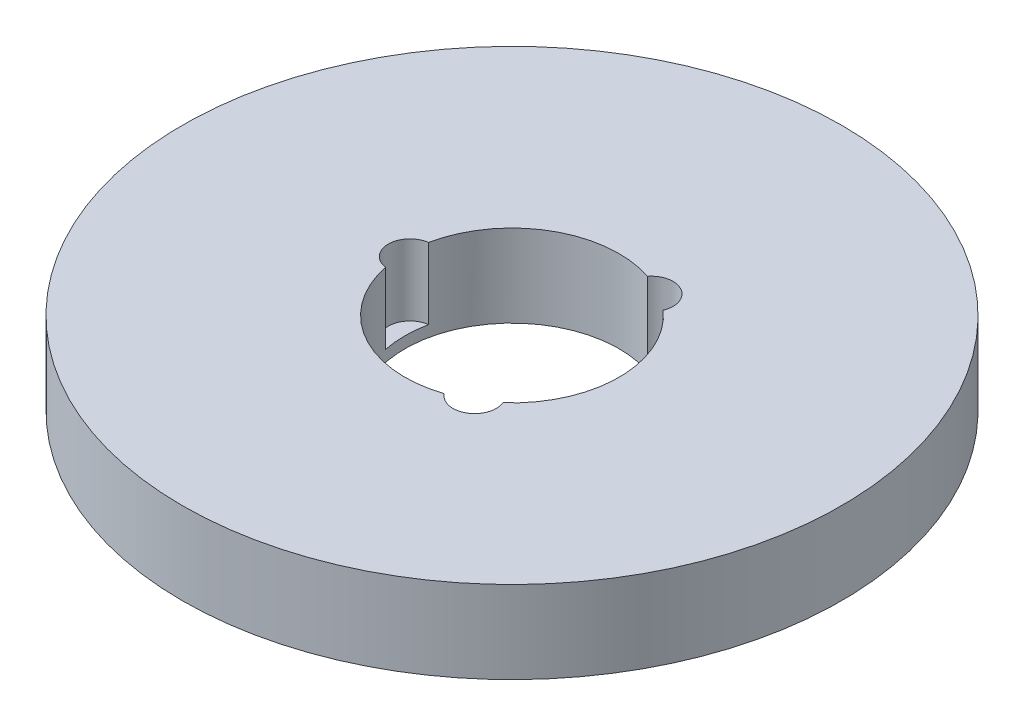
ISO-10303-21;
HEADER;
FILE_DESCRIPTION(('STEP AP214'),'2;1');
FILE_NAME('part.step','',(''),(''),'','','');
FILE_SCHEMA(('AUTOMOTIVE_DESIGN { 1 0 10303 214 1 1 1 1 }'));
ENDSEC;
DATA;
#1=APPLICATION_CONTEXT('core data for automotive mechanical design processes');
#2=APPLICATION_PROTOCOL_DEFINITION('international standard','automotive_design',2000,#1);
#3=PRODUCT_CONTEXT('',#1,'mechanical');
#4=PRODUCT('Part','Part','',(#3));
#5=PRODUCT_RELATED_PRODUCT_CATEGORY('part','',(#4));
#6=PRODUCT_DEFINITION_FORMATION('','',#4);
#7=PRODUCT_DEFINITION_CONTEXT('part definition',#1,'design');
#8=PRODUCT_DEFINITION('design','',#6,#7);
#9=PRODUCT_DEFINITION_SHAPE('','',#8);
#10=(LENGTH_UNIT() NAMED_UNIT(*) SI_UNIT(.MILLI.,.METRE.));
#11=(NAMED_UNIT(*) PLANE_ANGLE_UNIT() SI_UNIT($,.RADIAN.));
#12=(NAMED_UNIT(*) SI_UNIT($,.STERADIAN.) SOLID_ANGLE_UNIT());
#13=UNCERTAINTY_MEASURE_WITH_UNIT(LENGTH_MEASURE(1.E-05),#10,'distance_accuracy_value','');
#14=(GEOMETRIC_REPRESENTATION_CONTEXT(3) GLOBAL_UNCERTAINTY_ASSIGNED_CONTEXT((#13)) GLOBAL_UNIT_ASSIGNED_CONTEXT((#10,
#11,#12)) REPRESENTATION_CONTEXT('',''));
#15=CARTESIAN_POINT('',(0.,0.,0.));
#16=DIRECTION('',(0.,0.,1.));
#17=DIRECTION('',(1.,0.,0.));
#18=AXIS2_PLACEMENT_3D('',#15,#16,#17);
#19=CARTESIAN_POINT('',(0.,25.,0.));
#20=DIRECTION('',(0.,-1.,0.));
#21=DIRECTION('',(0.,0.,-1.));
#22=AXIS2_PLACEMENT_3D('',#19,#20,#21);
#23=CYLINDRICAL_SURFACE('',#22,100.);
#24=CARTESIAN_POINT('',(0.,25.,0.));
#25=DIRECTION('',(0.,1.,0.));
#26=DIRECTION('',(0.,0.,1.));
#27=AXIS2_PLACEMENT_3D('',#24,#25,#26);
#28=CIRCLE('',#27,100.);
#29=CARTESIAN_POINT('',(0.,25.,100.));
#30=VERTEX_POINT('',#29);
#31=EDGE_CURVE('E130',#30,#30,#28,.T.);
#32=ORIENTED_EDGE('',*,*,#31,.F.);
#33=EDGE_LOOP('',(#32));
#34=FACE_BOUND('',#33,.T.);
#35=CARTESIAN_POINT('',(0.,0.,0.));
#36=DIRECTION('',(0.,1.,0.));
#37=DIRECTION('',(0.,0.,1.));
#38=AXIS2_PLACEMENT_3D('',#35,#36,#37);
#39=CIRCLE('',#38,100.);
#40=CARTESIAN_POINT('',(0.,0.,100.));
#41=VERTEX_POINT('',#40);
#42=EDGE_CURVE('E117',#41,#41,#39,.T.);
#43=ORIENTED_EDGE('',*,*,#42,.T.);
#44=EDGE_LOOP('',(#43));
#45=FACE_BOUND('',#44,.T.);
#46=ADVANCED_FACE('F39',(#34,#45),#23,.T.);
#47=CARTESIAN_POINT('',(0.,25.,0.));
#48=DIRECTION('',(0.,1.,0.));
#49=DIRECTION('',(0.,0.,1.));
#50=AXIS2_PLACEMENT_3D('',#47,#48,#49);
#51=PLANE('',#50);
#52=CARTESIAN_POINT('',(15.4759458741744,25.,26.8051245492558));
#53=DIRECTION('',(0.,1.,0.));
#54=DIRECTION('',(0.866025403784436,0.,-0.500000000000004));
#55=AXIS2_PLACEMENT_3D('',#52,#53,#54);
#56=CIRCLE('',#55,6.58557208859873);
#57=CARTESIAN_POINT('',(10.2676622109279,25.,30.8354522055747));
#58=VERTEX_POINT('',#57);
#59=CARTESIAN_POINT('',(21.5704538417449,25.,24.3097824149282));
#60=VERTEX_POINT('',#59);
#61=EDGE_CURVE('E148',#58,#60,#56,.T.);
#62=ORIENTED_EDGE('',*,*,#61,.F.);
#63=CARTESIAN_POINT('',(0.,25.,0.));
#64=DIRECTION('',(0.,1.,0.));
#65=DIRECTION('',(0.,0.,1.));
#66=AXIS2_PLACEMENT_3D('',#63,#64,#65);
#67=CIRCLE('',#66,32.5);
#68=CARTESIAN_POINT('',(-31.8381160526725,25.,6.5256697906465));
#69=VERTEX_POINT('',#68);
#70=EDGE_CURVE('E113',#69,#58,#67,.T.);
#71=ORIENTED_EDGE('',*,*,#70,.F.);
#72=CARTESIAN_POINT('',(-30.9518917483486,25.,0.));
#73=DIRECTION('',(0.,1.,0.));
#74=DIRECTION('',(0.,0.,1.));
#75=AXIS2_PLACEMENT_3D('',#72,#73,#74);
#76=CIRCLE('',#75,6.58557208859873);
#77=CARTESIAN_POINT('',(-31.8381160526725,25.,-6.5256697906465));
#78=VERTEX_POINT('',#77);
#79=EDGE_CURVE('E125',#78,#69,#76,.T.);
#80=ORIENTED_EDGE('',*,*,#79,.F.);
#81=CARTESIAN_POINT('',(10.2676622109274,25.,-30.8354522055749));
#82=VERTEX_POINT('',#81);
#83=EDGE_CURVE('E107',#82,#78,#67,.T.);
#84=ORIENTED_EDGE('',*,*,#83,.F.);
#85=CARTESIAN_POINT('',(15.4759458741741,25.,-26.805124549256));
#86=DIRECTION('',(0.,1.,0.));
#87=DIRECTION('',(-0.866025403784443,0.,-0.499999999999992));
#88=AXIS2_PLACEMENT_3D('',#85,#86,#87);
#89=CIRCLE('',#88,6.58557208859873);
#90=CARTESIAN_POINT('',(21.5704538417446,25.,-24.3097824149285));
#91=VERTEX_POINT('',#90);
#92=EDGE_CURVE('E95',#91,#82,#89,.T.);
#93=ORIENTED_EDGE('',*,*,#92,.F.);
#94=EDGE_CURVE('E106',#60,#91,#67,.T.);
#95=ORIENTED_EDGE('',*,*,#94,.F.);
#96=EDGE_LOOP('',(#62,#71,#80,#84,#93,#95));
#97=FACE_BOUND('',#96,.T.);
#98=ORIENTED_EDGE('',*,*,#31,.T.);
#99=EDGE_LOOP('',(#98));
#100=FACE_BOUND('',#99,.T.);
#101=ADVANCED_FACE('F102',(#97,#100),#51,.T.);
#102=CARTESIAN_POINT('',(0.,0.,0.));
#103=DIRECTION('',(0.,1.,0.));
#104=DIRECTION('',(0.,0.,1.));
#105=AXIS2_PLACEMENT_3D('',#102,#103,#104);
#106=PLANE('',#105);
#107=CARTESIAN_POINT('',(0.,0.,0.));
#108=DIRECTION('',(0.,1.,0.));
#109=DIRECTION('',(0.,0.,1.));
#110=AXIS2_PLACEMENT_3D('',#107,#108,#109);
#111=CIRCLE('',#110,32.5);
#112=CARTESIAN_POINT('',(0.,0.,32.5));
#113=VERTEX_POINT('',#112);
#114=EDGE_CURVE('E118',#113,#113,#111,.T.);
#115=ORIENTED_EDGE('',*,*,#114,.T.);
#116=EDGE_LOOP('',(#115));
#117=FACE_BOUND('',#116,.T.);
#118=ORIENTED_EDGE('',*,*,#42,.F.);
#119=EDGE_LOOP('',(#118));
#120=FACE_BOUND('',#119,.T.);
#121=ADVANCED_FACE('F161',(#117,#120),#106,.F.);
#122=CARTESIAN_POINT('',(0.,25.,0.));
#123=DIRECTION('',(0.,-1.,0.));
#124=DIRECTION('',(0.,0.,-1.));
#125=AXIS2_PLACEMENT_3D('',#122,#123,#124);
#126=CYLINDRICAL_SURFACE('',#125,32.5);
#127=DIRECTION('',(0.,1.,0.));
#128=VECTOR('',#127,1.);
#129=CARTESIAN_POINT('',(10.2676622109279,14.2063744967564,30.8354522055747));
#130=LINE('',#129,#128);
#131=CARTESIAN_POINT('',(10.2676622109279,3.41274899351281,30.8354522055747));
#132=VERTEX_POINT('',#131);
#133=EDGE_CURVE('E11',#132,#58,#130,.T.);
#134=ORIENTED_EDGE('',*,*,#133,.F.);
#135=CARTESIAN_POINT('',(0.,3.41274899351281,0.));
#136=DIRECTION('',(0.,1.,0.));
#137=DIRECTION('',(0.,0.,1.));
#138=AXIS2_PLACEMENT_3D('',#135,#136,#137);
#139=CIRCLE('',#138,32.5);
#140=CARTESIAN_POINT('',(21.5704538417449,3.41274899351281,24.3097824149282));
#141=VERTEX_POINT('',#140);
#142=EDGE_CURVE('E100',#132,#141,#139,.T.);
#143=ORIENTED_EDGE('',*,*,#142,.T.);
#144=DIRECTION('',(0.,1.,0.));
#145=VECTOR('',#144,1.);
#146=CARTESIAN_POINT('',(21.5704538417449,14.2063744967564,24.3097824149282));
#147=LINE('',#146,#145);
#148=EDGE_CURVE('E46',#60,#141,#147,.F.);
#149=ORIENTED_EDGE('',*,*,#148,.F.);
#150=ORIENTED_EDGE('',*,*,#94,.T.);
#151=DIRECTION('',(0.,1.,0.));
#152=VECTOR('',#151,1.);
#153=CARTESIAN_POINT('',(21.5704538417446,14.2063744967564,-24.3097824149285));
#154=LINE('',#153,#152);
#155=CARTESIAN_POINT('',(21.5704538417446,3.41274899351281,-24.3097824149285));
#156=VERTEX_POINT('',#155);
#157=EDGE_CURVE('E90',#156,#91,#154,.T.);
#158=ORIENTED_EDGE('',*,*,#157,.F.);
#159=CARTESIAN_POINT('',(0.,3.41274899351281,0.));
#160=DIRECTION('',(0.,1.,0.));
#161=DIRECTION('',(0.,0.,1.));
#162=AXIS2_PLACEMENT_3D('',#159,#160,#161);
#163=CIRCLE('',#162,32.5);
#164=CARTESIAN_POINT('',(10.2676622109274,3.41274899351281,-30.8354522055749));
#165=VERTEX_POINT('',#164);
#166=EDGE_CURVE('E143',#156,#165,#163,.T.);
#167=ORIENTED_EDGE('',*,*,#166,.T.);
#168=DIRECTION('',(0.,1.,0.));
#169=VECTOR('',#168,1.);
#170=CARTESIAN_POINT('',(10.2676622109274,14.2063744967564,-30.8354522055749));
#171=LINE('',#170,#169);
#172=EDGE_CURVE('E98',#82,#165,#171,.F.);
#173=ORIENTED_EDGE('',*,*,#172,.F.);
#174=ORIENTED_EDGE('',*,*,#83,.T.);
#175=DIRECTION('',(0.,1.,0.));
#176=VECTOR('',#175,1.);
#177=CARTESIAN_POINT('',(-31.8381160526725,14.2063744967564,-6.5256697906465));
#178=LINE('',#177,#176);
#179=CARTESIAN_POINT('',(-31.8381160526725,3.41274899351281,-6.5256697906465));
#180=VERTEX_POINT('',#179);
#181=EDGE_CURVE('E137',#180,#78,#178,.T.);
#182=ORIENTED_EDGE('',*,*,#181,.F.);
#183=CARTESIAN_POINT('',(0.,3.41274899351281,0.));
#184=DIRECTION('',(0.,1.,0.));
#185=DIRECTION('',(0.,0.,1.));
#186=AXIS2_PLACEMENT_3D('',#183,#184,#185);
#187=CIRCLE('',#186,32.5);
#188=CARTESIAN_POINT('',(-31.8381160526725,3.41274899351281,6.5256697906465));
#189=VERTEX_POINT('',#188);
#190=EDGE_CURVE('E128',#180,#189,#187,.T.);
#191=ORIENTED_EDGE('',*,*,#190,.T.);
#192=DIRECTION('',(0.,1.,0.));
#193=VECTOR('',#192,1.);
#194=CARTESIAN_POINT('',(-31.8381160526725,14.2063744967564,6.5256697906465));
#195=LINE('',#194,#193);
#196=EDGE_CURVE('E134',#69,#189,#195,.F.);
#197=ORIENTED_EDGE('',*,*,#196,.F.);
#198=ORIENTED_EDGE('',*,*,#70,.T.);
#199=EDGE_LOOP('',(#134,#143,#149,#150,#158,#167,#173,#174,#182,#191,#197,#198));
#200=FACE_BOUND('',#199,.T.);
#201=ORIENTED_EDGE('',*,*,#114,.F.);
#202=EDGE_LOOP('',(#201));
#203=FACE_BOUND('',#202,.T.);
#204=ADVANCED_FACE('F115',(#200,#203),#126,.F.);
#205=CARTESIAN_POINT('',(-30.9518917483486,3.41274899351281,0.));
#206=DIRECTION('',(0.,1.,0.));
#207=DIRECTION('',(0.,0.,1.));
#208=AXIS2_PLACEMENT_3D('',#205,#206,#207);
#209=CYLINDRICAL_SURFACE('',#208,6.58557208859873);
#210=ORIENTED_EDGE('',*,*,#181,.T.);
#211=ORIENTED_EDGE('',*,*,#79,.T.);
#212=ORIENTED_EDGE('',*,*,#196,.T.);
#213=CARTESIAN_POINT('',(-30.9518917483486,3.41274899351281,0.));
#214=DIRECTION('',(0.,1.,0.));
#215=DIRECTION('',(0.,0.,1.));
#216=AXIS2_PLACEMENT_3D('',#213,#214,#215);
#217=CIRCLE('',#216,6.58557208859873);
#218=EDGE_CURVE('E127',#180,#189,#217,.T.);
#219=ORIENTED_EDGE('',*,*,#218,.F.);
#220=EDGE_LOOP('',(#210,#211,#212,#219));
#221=FACE_BOUND('',#220,.T.);
#222=ADVANCED_FACE('F175',(#221),#209,.F.);
#223=CARTESIAN_POINT('',(-30.9518917483486,3.41274899351281,0.));
#224=DIRECTION('',(0.,1.,0.));
#225=DIRECTION('',(0.,0.,1.));
#226=AXIS2_PLACEMENT_3D('',#223,#224,#225);
#227=PLANE('',#226);
#228=ORIENTED_EDGE('',*,*,#218,.T.);
#229=ORIENTED_EDGE('',*,*,#190,.F.);
#230=EDGE_LOOP('',(#228,#229));
#231=FACE_BOUND('',#230,.T.);
#232=ADVANCED_FACE('F176',(#231),#227,.T.);
#233=CARTESIAN_POINT('',(15.4759458741741,3.41274899351281,-26.805124549256));
#234=DIRECTION('',(0.,1.,0.));
#235=DIRECTION('',(0.,0.,1.));
#236=AXIS2_PLACEMENT_3D('',#233,#234,#235);
#237=CYLINDRICAL_SURFACE('',#236,6.58557208859873);
#238=ORIENTED_EDGE('',*,*,#157,.T.);
#239=ORIENTED_EDGE('',*,*,#92,.T.);
#240=ORIENTED_EDGE('',*,*,#172,.T.);
#241=CARTESIAN_POINT('',(15.4759458741741,3.41274899351281,-26.805124549256));
#242=DIRECTION('',(0.,1.,0.));
#243=DIRECTION('',(-0.866025403784443,0.,-0.499999999999992));
#244=AXIS2_PLACEMENT_3D('',#241,#242,#243);
#245=CIRCLE('',#244,6.58557208859873);
#246=EDGE_CURVE('E56',#156,#165,#245,.T.);
#247=ORIENTED_EDGE('',*,*,#246,.F.);
#248=EDGE_LOOP('',(#238,#239,#240,#247));
#249=FACE_BOUND('',#248,.T.);
#250=ADVANCED_FACE('F93',(#249),#237,.F.);
#251=CARTESIAN_POINT('',(15.4759458741741,3.41274899351281,-26.805124549256));
#252=DIRECTION('',(0.,1.,0.));
#253=DIRECTION('',(-0.866025403784443,0.,-0.499999999999992));
#254=AXIS2_PLACEMENT_3D('',#251,#252,#253);
#255=PLANE('',#254);
#256=ORIENTED_EDGE('',*,*,#246,.T.);
#257=ORIENTED_EDGE('',*,*,#166,.F.);
#258=EDGE_LOOP('',(#256,#257));
#259=FACE_BOUND('',#258,.T.);
#260=ADVANCED_FACE('F153',(#259),#255,.T.);
#261=CARTESIAN_POINT('',(15.4759458741744,3.41274899351281,26.8051245492558));
#262=DIRECTION('',(0.,1.,0.));
#263=DIRECTION('',(0.,0.,1.));
#264=AXIS2_PLACEMENT_3D('',#261,#262,#263);
#265=CYLINDRICAL_SURFACE('',#264,6.58557208859873);
#266=ORIENTED_EDGE('',*,*,#133,.T.);
#267=ORIENTED_EDGE('',*,*,#61,.T.);
#268=ORIENTED_EDGE('',*,*,#148,.T.);
#269=CARTESIAN_POINT('',(15.4759458741744,3.41274899351281,26.8051245492558));
#270=DIRECTION('',(0.,1.,0.));
#271=DIRECTION('',(0.866025403784436,0.,-0.500000000000004));
#272=AXIS2_PLACEMENT_3D('',#269,#270,#271);
#273=CIRCLE('',#272,6.58557208859873);
#274=EDGE_CURVE('E55',#132,#141,#273,.T.);
#275=ORIENTED_EDGE('',*,*,#274,.F.);
#276=EDGE_LOOP('',(#266,#267,#268,#275));
#277=FACE_BOUND('',#276,.T.);
#278=ADVANCED_FACE('F144',(#277),#265,.F.);
#279=CARTESIAN_POINT('',(15.4759458741744,3.41274899351281,26.8051245492558));
#280=DIRECTION('',(0.,1.,0.));
#281=DIRECTION('',(0.866025403784436,0.,-0.500000000000004));
#282=AXIS2_PLACEMENT_3D('',#279,#280,#281);
#283=PLANE('',#282);
#284=ORIENTED_EDGE('',*,*,#274,.T.);
#285=ORIENTED_EDGE('',*,*,#142,.F.);
#286=EDGE_LOOP('',(#284,#285));
#287=FACE_BOUND('',#286,.T.);
#288=ADVANCED_FACE('F150',(#287),#283,.T.);
#289=CLOSED_SHELL('',(#46,#101,#121,#204,#222,#232,#250,#260,#278,#288));
#290=MANIFOLD_SOLID_BREP('B2',#289);
#291=ADVANCED_BREP_SHAPE_REPRESENTATION('',(#18,#290),#14);
#292=SHAPE_DEFINITION_REPRESENTATION(#9,#291);
ENDSEC;
END-ISO-10303-21;
